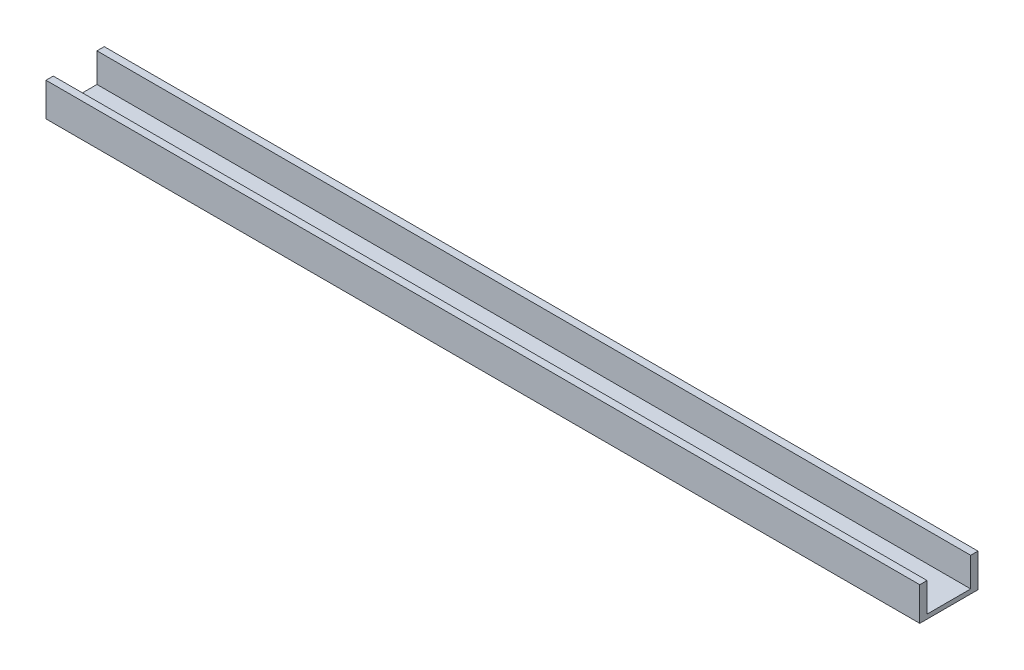
ISO-10303-21;
HEADER;
FILE_DESCRIPTION(('STEP AP214'),'2;1');
FILE_NAME('part.step','',(''),(''),'','','');
FILE_SCHEMA(('AUTOMOTIVE_DESIGN { 1 0 10303 214 1 1 1 1 }'));
ENDSEC;
DATA;
#1=APPLICATION_CONTEXT('core data for automotive mechanical design processes');
#2=APPLICATION_PROTOCOL_DEFINITION('international standard','automotive_design',2000,#1);
#3=PRODUCT_CONTEXT('',#1,'mechanical');
#4=PRODUCT('Part','Part','',(#3));
#5=PRODUCT_RELATED_PRODUCT_CATEGORY('part','',(#4));
#6=PRODUCT_DEFINITION_FORMATION('','',#4);
#7=PRODUCT_DEFINITION_CONTEXT('part definition',#1,'design');
#8=PRODUCT_DEFINITION('design','',#6,#7);
#9=PRODUCT_DEFINITION_SHAPE('','',#8);
#10=(LENGTH_UNIT() NAMED_UNIT(*) SI_UNIT(.MILLI.,.METRE.));
#11=(NAMED_UNIT(*) PLANE_ANGLE_UNIT() SI_UNIT($,.RADIAN.));
#12=(NAMED_UNIT(*) SI_UNIT($,.STERADIAN.) SOLID_ANGLE_UNIT());
#13=UNCERTAINTY_MEASURE_WITH_UNIT(LENGTH_MEASURE(1.E-05),#10,'distance_accuracy_value','');
#14=(GEOMETRIC_REPRESENTATION_CONTEXT(3) GLOBAL_UNCERTAINTY_ASSIGNED_CONTEXT((#13)) GLOBAL_UNIT_ASSIGNED_CONTEXT((#10,
#11,#12)) REPRESENTATION_CONTEXT('',''));
#15=CARTESIAN_POINT('',(0.,0.,0.));
#16=DIRECTION('',(0.,0.,1.));
#17=DIRECTION('',(1.,0.,0.));
#18=AXIS2_PLACEMENT_3D('',#15,#16,#17);
#19=CARTESIAN_POINT('',(0.,3.,0.));
#20=DIRECTION('',(0.,1.,0.));
#21=DIRECTION('',(0.,0.,1.));
#22=AXIS2_PLACEMENT_3D('',#19,#20,#21);
#23=PLANE('',#22);
#24=DIRECTION('',(0.,0.,1.));
#25=VECTOR('',#24,1.);
#26=CARTESIAN_POINT('',(-300.,3.,-20.));
#27=LINE('',#26,#25);
#28=CARTESIAN_POINT('',(-300.,3.,-15.));
#29=VERTEX_POINT('',#28);
#30=CARTESIAN_POINT('',(-300.,3.,15.));
#31=VERTEX_POINT('',#30);
#32=EDGE_CURVE('E115',#29,#31,#27,.T.);
#33=ORIENTED_EDGE('',*,*,#32,.T.);
#34=DIRECTION('',(-1.,0.,0.));
#35=VECTOR('',#34,1.);
#36=CARTESIAN_POINT('',(-300.,3.,15.));
#37=LINE('',#36,#35);
#38=CARTESIAN_POINT('',(300.,3.,15.));
#39=VERTEX_POINT('',#38);
#40=EDGE_CURVE('E104',#39,#31,#37,.T.);
#41=ORIENTED_EDGE('',*,*,#40,.F.);
#42=DIRECTION('',(0.,0.,-1.));
#43=VECTOR('',#42,1.);
#44=CARTESIAN_POINT('',(300.,3.,-20.));
#45=LINE('',#44,#43);
#46=CARTESIAN_POINT('',(300.,3.,-15.));
#47=VERTEX_POINT('',#46);
#48=EDGE_CURVE('E121',#39,#47,#45,.T.);
#49=ORIENTED_EDGE('',*,*,#48,.T.);
#50=DIRECTION('',(1.,0.,0.));
#51=VECTOR('',#50,1.);
#52=CARTESIAN_POINT('',(300.,3.,-15.));
#53=LINE('',#52,#51);
#54=EDGE_CURVE('E62',#29,#47,#53,.T.);
#55=ORIENTED_EDGE('',*,*,#54,.F.);
#56=EDGE_LOOP('',(#33,#41,#49,#55));
#57=FACE_BOUND('',#56,.T.);
#58=ADVANCED_FACE('F39',(#57),#23,.T.);
#59=CARTESIAN_POINT('',(300.,3.,-20.));
#60=DIRECTION('',(-1.,0.,0.));
#61=DIRECTION('',(0.,0.,1.));
#62=AXIS2_PLACEMENT_3D('',#59,#60,#61);
#63=PLANE('',#62);
#64=DIRECTION('',(0.,0.,-1.));
#65=VECTOR('',#64,1.);
#66=CARTESIAN_POINT('',(300.,0.,-20.));
#67=LINE('',#66,#65);
#68=CARTESIAN_POINT('',(300.,0.,20.));
#69=VERTEX_POINT('',#68);
#70=CARTESIAN_POINT('',(300.,0.,-20.));
#71=VERTEX_POINT('',#70);
#72=EDGE_CURVE('E130',#69,#71,#67,.T.);
#73=ORIENTED_EDGE('',*,*,#72,.T.);
#74=DIRECTION('',(0.,-1.,0.));
#75=VECTOR('',#74,1.);
#76=CARTESIAN_POINT('',(300.,3.,-20.));
#77=LINE('',#76,#75);
#78=CARTESIAN_POINT('',(300.,23.,-20.));
#79=VERTEX_POINT('',#78);
#80=EDGE_CURVE('E11',#79,#71,#77,.T.);
#81=ORIENTED_EDGE('',*,*,#80,.F.);
#82=DIRECTION('',(0.,0.,-1.));
#83=VECTOR('',#82,1.);
#84=CARTESIAN_POINT('',(300.,23.,-20.));
#85=LINE('',#84,#83);
#86=CARTESIAN_POINT('',(300.,23.,-15.));
#87=VERTEX_POINT('',#86);
#88=EDGE_CURVE('E165',#87,#79,#85,.T.);
#89=ORIENTED_EDGE('',*,*,#88,.F.);
#90=DIRECTION('',(0.,-1.,0.));
#91=VECTOR('',#90,1.);
#92=CARTESIAN_POINT('',(300.,23.,-15.));
#93=LINE('',#92,#91);
#94=EDGE_CURVE('E173',#87,#47,#93,.T.);
#95=ORIENTED_EDGE('',*,*,#94,.T.);
#96=ORIENTED_EDGE('',*,*,#48,.F.);
#97=DIRECTION('',(0.,-1.,0.));
#98=VECTOR('',#97,1.);
#99=CARTESIAN_POINT('',(300.,23.,15.));
#100=LINE('',#99,#98);
#101=CARTESIAN_POINT('',(300.,23.,15.));
#102=VERTEX_POINT('',#101);
#103=EDGE_CURVE('E54',#102,#39,#100,.T.);
#104=ORIENTED_EDGE('',*,*,#103,.F.);
#105=DIRECTION('',(0.,0.,-1.));
#106=VECTOR('',#105,1.);
#107=CARTESIAN_POINT('',(300.,23.,15.));
#108=LINE('',#107,#106);
#109=CARTESIAN_POINT('',(300.,23.,20.));
#110=VERTEX_POINT('',#109);
#111=EDGE_CURVE('E157',#110,#102,#108,.T.);
#112=ORIENTED_EDGE('',*,*,#111,.F.);
#113=DIRECTION('',(0.,-1.,0.));
#114=VECTOR('',#113,1.);
#115=CARTESIAN_POINT('',(300.,3.,20.));
#116=LINE('',#115,#114);
#117=EDGE_CURVE('E120',#110,#69,#116,.T.);
#118=ORIENTED_EDGE('',*,*,#117,.T.);
#119=EDGE_LOOP('',(#73,#81,#89,#95,#96,#104,#112,#118));
#120=FACE_BOUND('',#119,.T.);
#121=ADVANCED_FACE('F41',(#120),#63,.F.);
#122=CARTESIAN_POINT('',(-300.,3.,-20.));
#123=DIRECTION('',(0.,0.,1.));
#124=DIRECTION('',(1.,0.,0.));
#125=AXIS2_PLACEMENT_3D('',#122,#123,#124);
#126=PLANE('',#125);
#127=DIRECTION('',(-1.,0.,0.));
#128=VECTOR('',#127,1.);
#129=CARTESIAN_POINT('',(-300.,0.,-20.));
#130=LINE('',#129,#128);
#131=CARTESIAN_POINT('',(-300.,0.,-20.));
#132=VERTEX_POINT('',#131);
#133=EDGE_CURVE('E133',#71,#132,#130,.T.);
#134=ORIENTED_EDGE('',*,*,#133,.T.);
#135=DIRECTION('',(0.,-1.,0.));
#136=VECTOR('',#135,1.);
#137=CARTESIAN_POINT('',(-300.,3.,-20.));
#138=LINE('',#137,#136);
#139=CARTESIAN_POINT('',(-300.,23.,-20.));
#140=VERTEX_POINT('',#139);
#141=EDGE_CURVE('E47',#140,#132,#138,.T.);
#142=ORIENTED_EDGE('',*,*,#141,.F.);
#143=DIRECTION('',(-1.,0.,0.));
#144=VECTOR('',#143,1.);
#145=CARTESIAN_POINT('',(300.,23.,-20.));
#146=LINE('',#145,#144);
#147=EDGE_CURVE('E168',#79,#140,#146,.T.);
#148=ORIENTED_EDGE('',*,*,#147,.F.);
#149=ORIENTED_EDGE('',*,*,#80,.T.);
#150=EDGE_LOOP('',(#134,#142,#148,#149));
#151=FACE_BOUND('',#150,.T.);
#152=ADVANCED_FACE('F183',(#151),#126,.F.);
#153=CARTESIAN_POINT('',(-300.,3.,-20.));
#154=DIRECTION('',(1.,0.,0.));
#155=DIRECTION('',(0.,0.,-1.));
#156=AXIS2_PLACEMENT_3D('',#153,#154,#155);
#157=PLANE('',#156);
#158=DIRECTION('',(0.,0.,1.));
#159=VECTOR('',#158,1.);
#160=CARTESIAN_POINT('',(-300.,0.,-20.));
#161=LINE('',#160,#159);
#162=CARTESIAN_POINT('',(-300.,0.,20.));
#163=VERTEX_POINT('',#162);
#164=EDGE_CURVE('E136',#132,#163,#161,.T.);
#165=ORIENTED_EDGE('',*,*,#164,.T.);
#166=DIRECTION('',(0.,-1.,0.));
#167=VECTOR('',#166,1.);
#168=CARTESIAN_POINT('',(-300.,3.,20.));
#169=LINE('',#168,#167);
#170=CARTESIAN_POINT('',(-300.,23.,20.));
#171=VERTEX_POINT('',#170);
#172=EDGE_CURVE('E124',#171,#163,#169,.T.);
#173=ORIENTED_EDGE('',*,*,#172,.F.);
#174=DIRECTION('',(0.,0.,1.));
#175=VECTOR('',#174,1.);
#176=CARTESIAN_POINT('',(-300.,23.,15.));
#177=LINE('',#176,#175);
#178=CARTESIAN_POINT('',(-300.,23.,15.));
#179=VERTEX_POINT('',#178);
#180=EDGE_CURVE('E110',#179,#171,#177,.T.);
#181=ORIENTED_EDGE('',*,*,#180,.F.);
#182=DIRECTION('',(0.,-1.,0.));
#183=VECTOR('',#182,1.);
#184=CARTESIAN_POINT('',(-300.,23.,15.));
#185=LINE('',#184,#183);
#186=EDGE_CURVE('E107',#179,#31,#185,.T.);
#187=ORIENTED_EDGE('',*,*,#186,.T.);
#188=ORIENTED_EDGE('',*,*,#32,.F.);
#189=DIRECTION('',(0.,-1.,0.));
#190=VECTOR('',#189,1.);
#191=CARTESIAN_POINT('',(-300.,23.,-15.));
#192=LINE('',#191,#190);
#193=CARTESIAN_POINT('',(-300.,23.,-15.));
#194=VERTEX_POINT('',#193);
#195=EDGE_CURVE('E134',#194,#29,#192,.T.);
#196=ORIENTED_EDGE('',*,*,#195,.F.);
#197=DIRECTION('',(0.,0.,1.));
#198=VECTOR('',#197,1.);
#199=CARTESIAN_POINT('',(-300.,23.,-20.));
#200=LINE('',#199,#198);
#201=EDGE_CURVE('E143',#140,#194,#200,.T.);
#202=ORIENTED_EDGE('',*,*,#201,.F.);
#203=ORIENTED_EDGE('',*,*,#141,.T.);
#204=EDGE_LOOP('',(#165,#173,#181,#187,#188,#196,#202,#203));
#205=FACE_BOUND('',#204,.T.);
#206=ADVANCED_FACE('F113',(#205),#157,.F.);
#207=CARTESIAN_POINT('',(-300.,3.,20.));
#208=DIRECTION('',(0.,0.,-1.));
#209=DIRECTION('',(-1.,0.,0.));
#210=AXIS2_PLACEMENT_3D('',#207,#208,#209);
#211=PLANE('',#210);
#212=DIRECTION('',(1.,0.,0.));
#213=VECTOR('',#212,1.);
#214=CARTESIAN_POINT('',(-300.,0.,20.));
#215=LINE('',#214,#213);
#216=EDGE_CURVE('E126',#163,#69,#215,.T.);
#217=ORIENTED_EDGE('',*,*,#216,.T.);
#218=ORIENTED_EDGE('',*,*,#117,.F.);
#219=DIRECTION('',(1.,0.,0.));
#220=VECTOR('',#219,1.);
#221=CARTESIAN_POINT('',(-300.,23.,20.));
#222=LINE('',#221,#220);
#223=EDGE_CURVE('E159',#171,#110,#222,.T.);
#224=ORIENTED_EDGE('',*,*,#223,.F.);
#225=ORIENTED_EDGE('',*,*,#172,.T.);
#226=EDGE_LOOP('',(#217,#218,#224,#225));
#227=FACE_BOUND('',#226,.T.);
#228=ADVANCED_FACE('F152',(#227),#211,.F.);
#229=CARTESIAN_POINT('',(0.,0.,0.));
#230=DIRECTION('',(0.,1.,0.));
#231=DIRECTION('',(0.,0.,1.));
#232=AXIS2_PLACEMENT_3D('',#229,#230,#231);
#233=PLANE('',#232);
#234=ORIENTED_EDGE('',*,*,#72,.F.);
#235=ORIENTED_EDGE('',*,*,#216,.F.);
#236=ORIENTED_EDGE('',*,*,#164,.F.);
#237=ORIENTED_EDGE('',*,*,#133,.F.);
#238=EDGE_LOOP('',(#234,#235,#236,#237));
#239=FACE_BOUND('',#238,.T.);
#240=ADVANCED_FACE('F150',(#239),#233,.F.);
#241=CARTESIAN_POINT('',(300.,23.,-15.));
#242=DIRECTION('',(0.,0.,-1.));
#243=DIRECTION('',(-1.,0.,0.));
#244=AXIS2_PLACEMENT_3D('',#241,#242,#243);
#245=PLANE('',#244);
#246=ORIENTED_EDGE('',*,*,#54,.T.);
#247=ORIENTED_EDGE('',*,*,#94,.F.);
#248=DIRECTION('',(1.,0.,0.));
#249=VECTOR('',#248,1.);
#250=CARTESIAN_POINT('',(300.,23.,-15.));
#251=LINE('',#250,#249);
#252=EDGE_CURVE('E171',#194,#87,#251,.T.);
#253=ORIENTED_EDGE('',*,*,#252,.F.);
#254=ORIENTED_EDGE('',*,*,#195,.T.);
#255=EDGE_LOOP('',(#246,#247,#253,#254));
#256=FACE_BOUND('',#255,.T.);
#257=ADVANCED_FACE('F178',(#256),#245,.F.);
#258=CARTESIAN_POINT('',(0.,23.,0.));
#259=DIRECTION('',(0.,-1.,0.));
#260=DIRECTION('',(0.,0.,-1.));
#261=AXIS2_PLACEMENT_3D('',#258,#259,#260);
#262=PLANE('',#261);
#263=ORIENTED_EDGE('',*,*,#88,.T.);
#264=ORIENTED_EDGE('',*,*,#147,.T.);
#265=ORIENTED_EDGE('',*,*,#201,.T.);
#266=ORIENTED_EDGE('',*,*,#252,.T.);
#267=EDGE_LOOP('',(#263,#264,#265,#266));
#268=FACE_BOUND('',#267,.T.);
#269=ADVANCED_FACE('F182',(#268),#262,.F.);
#270=CARTESIAN_POINT('',(-300.,23.,15.));
#271=DIRECTION('',(0.,0.,1.));
#272=DIRECTION('',(1.,0.,0.));
#273=AXIS2_PLACEMENT_3D('',#270,#271,#272);
#274=PLANE('',#273);
#275=ORIENTED_EDGE('',*,*,#40,.T.);
#276=ORIENTED_EDGE('',*,*,#186,.F.);
#277=DIRECTION('',(-1.,0.,0.));
#278=VECTOR('',#277,1.);
#279=CARTESIAN_POINT('',(-300.,23.,15.));
#280=LINE('',#279,#278);
#281=EDGE_CURVE('E118',#102,#179,#280,.T.);
#282=ORIENTED_EDGE('',*,*,#281,.F.);
#283=ORIENTED_EDGE('',*,*,#103,.T.);
#284=EDGE_LOOP('',(#275,#276,#282,#283));
#285=FACE_BOUND('',#284,.T.);
#286=ADVANCED_FACE('F106',(#285),#274,.F.);
#287=CARTESIAN_POINT('',(0.,23.,0.));
#288=DIRECTION('',(0.,1.,0.));
#289=DIRECTION('',(0.,0.,1.));
#290=AXIS2_PLACEMENT_3D('',#287,#288,#289);
#291=PLANE('',#290);
#292=ORIENTED_EDGE('',*,*,#180,.T.);
#293=ORIENTED_EDGE('',*,*,#223,.T.);
#294=ORIENTED_EDGE('',*,*,#111,.T.);
#295=ORIENTED_EDGE('',*,*,#281,.T.);
#296=EDGE_LOOP('',(#292,#293,#294,#295));
#297=FACE_BOUND('',#296,.T.);
#298=ADVANCED_FACE('F223',(#297),#291,.T.);
#299=CLOSED_SHELL('',(#58,#121,#152,#206,#228,#240,#257,#269,#286,#298));
#300=MANIFOLD_SOLID_BREP('B2',#299);
#301=ADVANCED_BREP_SHAPE_REPRESENTATION('',(#18,#300),#14);
#302=SHAPE_DEFINITION_REPRESENTATION(#9,#301);
ENDSEC;
END-ISO-10303-21;
